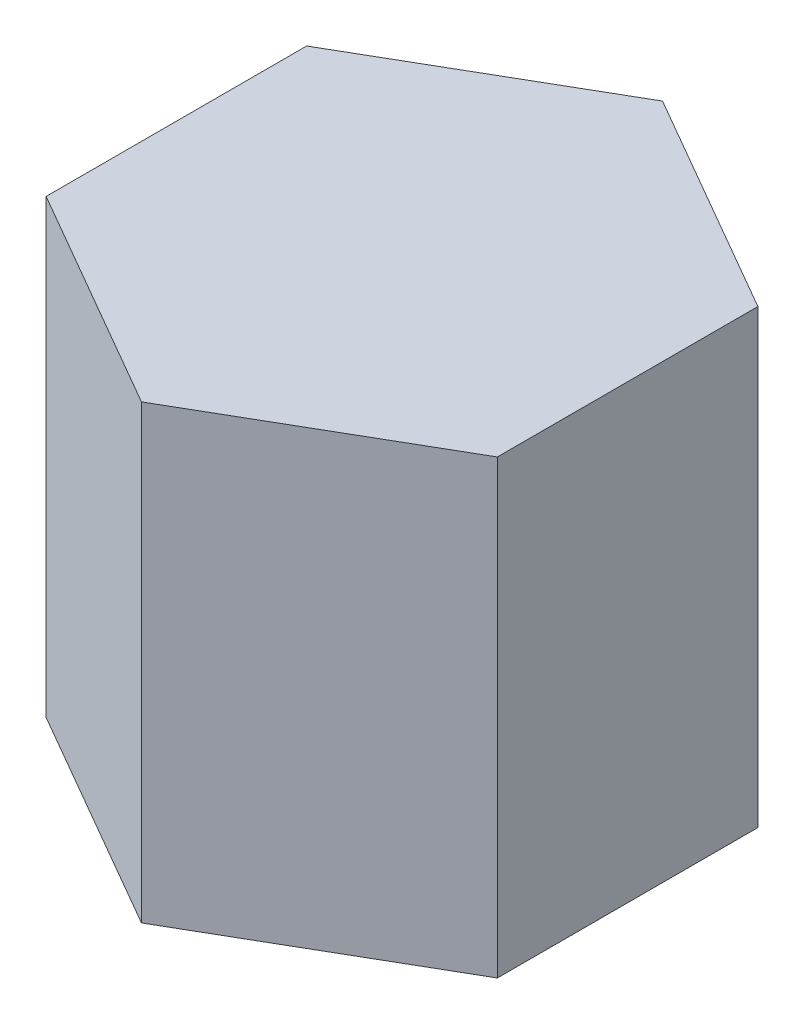
ISO-10303-21;
HEADER;
FILE_DESCRIPTION(('STEP AP214'),'2;1');
FILE_NAME('part.step','',(''),(''),'','','');
FILE_SCHEMA(('AUTOMOTIVE_DESIGN { 1 0 10303 214 1 1 1 1 }'));
ENDSEC;
DATA;
#1=APPLICATION_CONTEXT('core data for automotive mechanical design processes');
#2=APPLICATION_PROTOCOL_DEFINITION('international standard','automotive_design',2000,#1);
#3=PRODUCT_CONTEXT('',#1,'mechanical');
#4=PRODUCT('Part','Part','',(#3));
#5=PRODUCT_RELATED_PRODUCT_CATEGORY('part','',(#4));
#6=PRODUCT_DEFINITION_FORMATION('','',#4);
#7=PRODUCT_DEFINITION_CONTEXT('part definition',#1,'design');
#8=PRODUCT_DEFINITION('design','',#6,#7);
#9=PRODUCT_DEFINITION_SHAPE('','',#8);
#10=(LENGTH_UNIT() NAMED_UNIT(*) SI_UNIT(.MILLI.,.METRE.));
#11=(NAMED_UNIT(*) PLANE_ANGLE_UNIT() SI_UNIT($,.RADIAN.));
#12=(NAMED_UNIT(*) SI_UNIT($,.STERADIAN.) SOLID_ANGLE_UNIT());
#13=UNCERTAINTY_MEASURE_WITH_UNIT(LENGTH_MEASURE(1.E-05),#10,'distance_accuracy_value','');
#14=(GEOMETRIC_REPRESENTATION_CONTEXT(3) GLOBAL_UNCERTAINTY_ASSIGNED_CONTEXT((#13)) GLOBAL_UNIT_ASSIGNED_CONTEXT((#10,
#11,#12)) REPRESENTATION_CONTEXT('',''));
#15=CARTESIAN_POINT('',(0.,0.,0.));
#16=DIRECTION('',(0.,0.,1.));
#17=DIRECTION('',(1.,0.,0.));
#18=AXIS2_PLACEMENT_3D('',#15,#16,#17);
#19=CARTESIAN_POINT('',(-25.,100.,43.3012701892219));
#20=DIRECTION('',(0.5,0.,-0.866025403784439));
#21=DIRECTION('',(-0.866025403784439,0.,-0.5));
#22=AXIS2_PLACEMENT_3D('',#19,#20,#21);
#23=PLANE('',#22);
#24=DIRECTION('',(0.866025403784439,0.,0.5));
#25=VECTOR('',#24,1.);
#26=CARTESIAN_POINT('',(-25.,0.,43.3012701892219));
#27=LINE('',#26,#25);
#28=CARTESIAN_POINT('',(-50.,0.,28.8675134594813));
#29=VERTEX_POINT('',#28);
#30=CARTESIAN_POINT('',(0.,0.,57.7350269189626));
#31=VERTEX_POINT('',#30);
#32=EDGE_CURVE('E117',#29,#31,#27,.T.);
#33=ORIENTED_EDGE('',*,*,#32,.T.);
#34=DIRECTION('',(0.,-1.,0.));
#35=VECTOR('',#34,1.);
#36=CARTESIAN_POINT('',(0.,100.,57.7350269189626));
#37=LINE('',#36,#35);
#38=CARTESIAN_POINT('',(0.,100.,57.7350269189626));
#39=VERTEX_POINT('',#38);
#40=EDGE_CURVE('E11',#39,#31,#37,.T.);
#41=ORIENTED_EDGE('',*,*,#40,.F.);
#42=DIRECTION('',(0.866025403784439,0.,0.5));
#43=VECTOR('',#42,1.);
#44=CARTESIAN_POINT('',(-25.,100.,43.3012701892219));
#45=LINE('',#44,#43);
#46=CARTESIAN_POINT('',(-50.,100.,28.8675134594813));
#47=VERTEX_POINT('',#46);
#48=EDGE_CURVE('E127',#47,#39,#45,.T.);
#49=ORIENTED_EDGE('',*,*,#48,.F.);
#50=DIRECTION('',(0.,-1.,0.));
#51=VECTOR('',#50,1.);
#52=CARTESIAN_POINT('',(-50.,100.,28.8675134594813));
#53=LINE('',#52,#51);
#54=EDGE_CURVE('E113',#47,#29,#53,.T.);
#55=ORIENTED_EDGE('',*,*,#54,.T.);
#56=EDGE_LOOP('',(#33,#41,#49,#55));
#57=FACE_BOUND('',#56,.T.);
#58=ADVANCED_FACE('F33',(#57),#23,.F.);
#59=CARTESIAN_POINT('',(25.,100.,43.3012701892219));
#60=DIRECTION('',(-0.5,0.,-0.866025403784439));
#61=DIRECTION('',(-0.866025403784439,0.,0.5));
#62=AXIS2_PLACEMENT_3D('',#59,#60,#61);
#63=PLANE('',#62);
#64=DIRECTION('',(0.866025403784439,0.,-0.5));
#65=VECTOR('',#64,1.);
#66=CARTESIAN_POINT('',(25.,0.,43.3012701892219));
#67=LINE('',#66,#65);
#68=CARTESIAN_POINT('',(50.,0.,28.8675134594813));
#69=VERTEX_POINT('',#68);
#70=EDGE_CURVE('E120',#31,#69,#67,.T.);
#71=ORIENTED_EDGE('',*,*,#70,.T.);
#72=DIRECTION('',(0.,-1.,0.));
#73=VECTOR('',#72,1.);
#74=CARTESIAN_POINT('',(50.,100.,28.8675134594813));
#75=LINE('',#74,#73);
#76=CARTESIAN_POINT('',(50.,100.,28.8675134594813));
#77=VERTEX_POINT('',#76);
#78=EDGE_CURVE('E41',#77,#69,#75,.T.);
#79=ORIENTED_EDGE('',*,*,#78,.F.);
#80=DIRECTION('',(0.866025403784439,0.,-0.5));
#81=VECTOR('',#80,1.);
#82=CARTESIAN_POINT('',(25.,100.,43.3012701892219));
#83=LINE('',#82,#81);
#84=EDGE_CURVE('E86',#39,#77,#83,.T.);
#85=ORIENTED_EDGE('',*,*,#84,.F.);
#86=ORIENTED_EDGE('',*,*,#40,.T.);
#87=EDGE_LOOP('',(#71,#79,#85,#86));
#88=FACE_BOUND('',#87,.T.);
#89=ADVANCED_FACE('F151',(#88),#63,.F.);
#90=CARTESIAN_POINT('',(50.,100.,0.));
#91=DIRECTION('',(-1.,0.,0.));
#92=DIRECTION('',(0.,0.,1.));
#93=AXIS2_PLACEMENT_3D('',#90,#91,#92);
#94=PLANE('',#93);
#95=DIRECTION('',(0.,0.,-1.));
#96=VECTOR('',#95,1.);
#97=CARTESIAN_POINT('',(50.,0.,0.));
#98=LINE('',#97,#96);
#99=CARTESIAN_POINT('',(50.,0.,-28.8675134594813));
#100=VERTEX_POINT('',#99);
#101=EDGE_CURVE('E122',#69,#100,#98,.T.);
#102=ORIENTED_EDGE('',*,*,#101,.T.);
#103=DIRECTION('',(0.,-1.,0.));
#104=VECTOR('',#103,1.);
#105=CARTESIAN_POINT('',(50.,100.,-28.8675134594813));
#106=LINE('',#105,#104);
#107=CARTESIAN_POINT('',(50.,100.,-28.8675134594813));
#108=VERTEX_POINT('',#107);
#109=EDGE_CURVE('E108',#108,#100,#106,.T.);
#110=ORIENTED_EDGE('',*,*,#109,.F.);
#111=DIRECTION('',(0.,0.,-1.));
#112=VECTOR('',#111,1.);
#113=CARTESIAN_POINT('',(50.,100.,0.));
#114=LINE('',#113,#112);
#115=EDGE_CURVE('E99',#77,#108,#114,.T.);
#116=ORIENTED_EDGE('',*,*,#115,.F.);
#117=ORIENTED_EDGE('',*,*,#78,.T.);
#118=EDGE_LOOP('',(#102,#110,#116,#117));
#119=FACE_BOUND('',#118,.T.);
#120=ADVANCED_FACE('F133',(#119),#94,.F.);
#121=CARTESIAN_POINT('',(25.,100.,-43.3012701892219));
#122=DIRECTION('',(-0.5,0.,0.866025403784439));
#123=DIRECTION('',(0.866025403784439,0.,0.5));
#124=AXIS2_PLACEMENT_3D('',#121,#122,#123);
#125=PLANE('',#124);
#126=DIRECTION('',(-0.866025403784439,0.,-0.5));
#127=VECTOR('',#126,1.);
#128=CARTESIAN_POINT('',(25.,0.,-43.3012701892219));
#129=LINE('',#128,#127);
#130=CARTESIAN_POINT('',(0.,0.,-57.7350269189626));
#131=VERTEX_POINT('',#130);
#132=EDGE_CURVE('E107',#100,#131,#129,.T.);
#133=ORIENTED_EDGE('',*,*,#132,.T.);
#134=DIRECTION('',(0.,-1.,0.));
#135=VECTOR('',#134,1.);
#136=CARTESIAN_POINT('',(0.,100.,-57.7350269189626));
#137=LINE('',#136,#135);
#138=CARTESIAN_POINT('',(0.,100.,-57.7350269189626));
#139=VERTEX_POINT('',#138);
#140=EDGE_CURVE('E104',#139,#131,#137,.T.);
#141=ORIENTED_EDGE('',*,*,#140,.F.);
#142=DIRECTION('',(-0.866025403784439,0.,-0.5));
#143=VECTOR('',#142,1.);
#144=CARTESIAN_POINT('',(25.,100.,-43.3012701892219));
#145=LINE('',#144,#143);
#146=EDGE_CURVE('E93',#108,#139,#145,.T.);
#147=ORIENTED_EDGE('',*,*,#146,.F.);
#148=ORIENTED_EDGE('',*,*,#109,.T.);
#149=EDGE_LOOP('',(#133,#141,#147,#148));
#150=FACE_BOUND('',#149,.T.);
#151=ADVANCED_FACE('F105',(#150),#125,.F.);
#152=CARTESIAN_POINT('',(-25.,100.,-43.301270189222));
#153=DIRECTION('',(0.5,0.,0.866025403784439));
#154=DIRECTION('',(0.866025403784439,0.,-0.5));
#155=AXIS2_PLACEMENT_3D('',#152,#153,#154);
#156=PLANE('',#155);
#157=DIRECTION('',(-0.866025403784439,0.,0.5));
#158=VECTOR('',#157,1.);
#159=CARTESIAN_POINT('',(-25.,0.,-43.301270189222));
#160=LINE('',#159,#158);
#161=CARTESIAN_POINT('',(-50.,0.,-28.8675134594813));
#162=VERTEX_POINT('',#161);
#163=EDGE_CURVE('E72',#131,#162,#160,.T.);
#164=ORIENTED_EDGE('',*,*,#163,.T.);
#165=DIRECTION('',(0.,-1.,0.));
#166=VECTOR('',#165,1.);
#167=CARTESIAN_POINT('',(-50.,100.,-28.8675134594813));
#168=LINE('',#167,#166);
#169=CARTESIAN_POINT('',(-50.,100.,-28.8675134594813));
#170=VERTEX_POINT('',#169);
#171=EDGE_CURVE('E109',#170,#162,#168,.T.);
#172=ORIENTED_EDGE('',*,*,#171,.F.);
#173=DIRECTION('',(-0.866025403784439,0.,0.5));
#174=VECTOR('',#173,1.);
#175=CARTESIAN_POINT('',(-25.,100.,-43.301270189222));
#176=LINE('',#175,#174);
#177=EDGE_CURVE('E97',#139,#170,#176,.T.);
#178=ORIENTED_EDGE('',*,*,#177,.F.);
#179=ORIENTED_EDGE('',*,*,#140,.T.);
#180=EDGE_LOOP('',(#164,#172,#178,#179));
#181=FACE_BOUND('',#180,.T.);
#182=ADVANCED_FACE('F111',(#181),#156,.F.);
#183=CARTESIAN_POINT('',(-50.,100.,0.));
#184=DIRECTION('',(1.,0.,0.));
#185=DIRECTION('',(0.,0.,-1.));
#186=AXIS2_PLACEMENT_3D('',#183,#184,#185);
#187=PLANE('',#186);
#188=DIRECTION('',(0.,0.,1.));
#189=VECTOR('',#188,1.);
#190=CARTESIAN_POINT('',(-50.,0.,0.));
#191=LINE('',#190,#189);
#192=EDGE_CURVE('E78',#162,#29,#191,.T.);
#193=ORIENTED_EDGE('',*,*,#192,.T.);
#194=ORIENTED_EDGE('',*,*,#54,.F.);
#195=DIRECTION('',(0.,0.,1.));
#196=VECTOR('',#195,1.);
#197=CARTESIAN_POINT('',(-50.,100.,0.));
#198=LINE('',#197,#196);
#199=EDGE_CURVE('E49',#170,#47,#198,.T.);
#200=ORIENTED_EDGE('',*,*,#199,.F.);
#201=ORIENTED_EDGE('',*,*,#171,.T.);
#202=EDGE_LOOP('',(#193,#194,#200,#201));
#203=FACE_BOUND('',#202,.T.);
#204=ADVANCED_FACE('F140',(#203),#187,.F.);
#205=CARTESIAN_POINT('',(0.,100.,0.));
#206=DIRECTION('',(0.,1.,0.));
#207=DIRECTION('',(0.,0.,1.));
#208=AXIS2_PLACEMENT_3D('',#205,#206,#207);
#209=PLANE('',#208);
#210=ORIENTED_EDGE('',*,*,#48,.T.);
#211=ORIENTED_EDGE('',*,*,#84,.T.);
#212=ORIENTED_EDGE('',*,*,#115,.T.);
#213=ORIENTED_EDGE('',*,*,#146,.T.);
#214=ORIENTED_EDGE('',*,*,#177,.T.);
#215=ORIENTED_EDGE('',*,*,#199,.T.);
#216=EDGE_LOOP('',(#210,#211,#212,#213,#214,#215));
#217=FACE_BOUND('',#216,.T.);
#218=ADVANCED_FACE('F95',(#217),#209,.T.);
#219=CARTESIAN_POINT('',(0.,0.,0.));
#220=DIRECTION('',(0.,1.,0.));
#221=DIRECTION('',(0.,0.,1.));
#222=AXIS2_PLACEMENT_3D('',#219,#220,#221);
#223=PLANE('',#222);
#224=ORIENTED_EDGE('',*,*,#32,.F.);
#225=ORIENTED_EDGE('',*,*,#192,.F.);
#226=ORIENTED_EDGE('',*,*,#163,.F.);
#227=ORIENTED_EDGE('',*,*,#132,.F.);
#228=ORIENTED_EDGE('',*,*,#101,.F.);
#229=ORIENTED_EDGE('',*,*,#70,.F.);
#230=EDGE_LOOP('',(#224,#225,#226,#227,#228,#229));
#231=FACE_BOUND('',#230,.T.);
#232=ADVANCED_FACE('F136',(#231),#223,.F.);
#233=CLOSED_SHELL('',(#58,#89,#120,#151,#182,#204,#218,#232));
#234=MANIFOLD_SOLID_BREP('B2',#233);
#235=ADVANCED_BREP_SHAPE_REPRESENTATION('',(#18,#234),#14);
#236=SHAPE_DEFINITION_REPRESENTATION(#9,#235);
ENDSEC;
END-ISO-10303-21;
